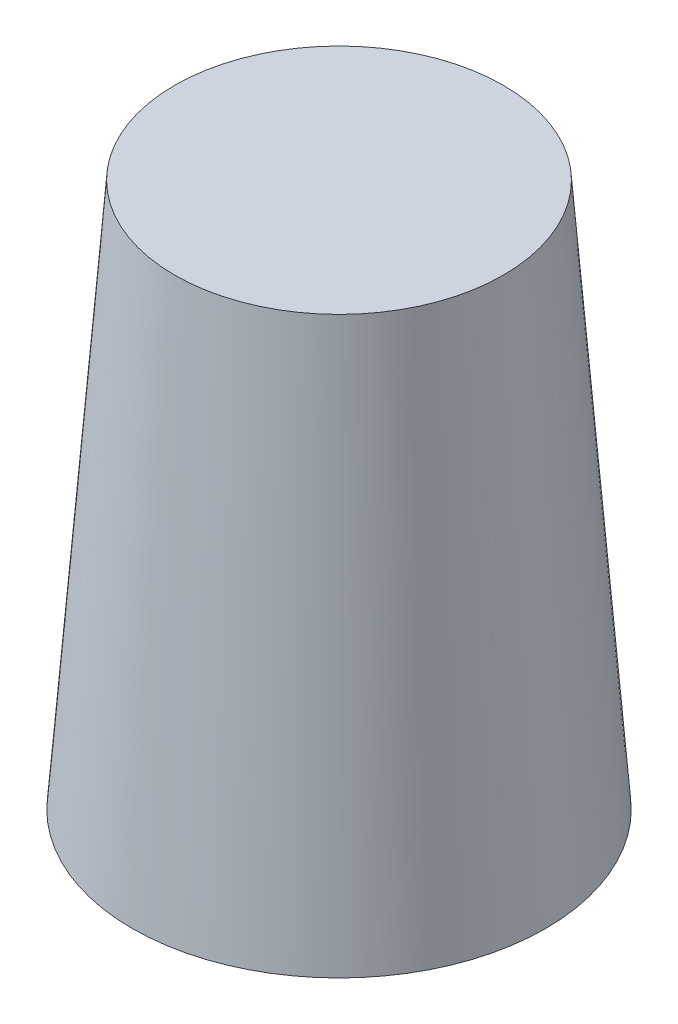
ISO-10303-21;
HEADER;
FILE_DESCRIPTION(('STEP AP214'),'2;1');
FILE_NAME('part.step','',(''),(''),'','','');
FILE_SCHEMA(('AUTOMOTIVE_DESIGN { 1 0 10303 214 1 1 1 1 }'));
ENDSEC;
DATA;
#1=APPLICATION_CONTEXT('core data for automotive mechanical design processes');
#2=APPLICATION_PROTOCOL_DEFINITION('international standard','automotive_design',2000,#1);
#3=PRODUCT_CONTEXT('',#1,'mechanical');
#4=PRODUCT('Part','Part','',(#3));
#5=PRODUCT_RELATED_PRODUCT_CATEGORY('part','',(#4));
#6=PRODUCT_DEFINITION_FORMATION('','',#4);
#7=PRODUCT_DEFINITION_CONTEXT('part definition',#1,'design');
#8=PRODUCT_DEFINITION('design','',#6,#7);
#9=PRODUCT_DEFINITION_SHAPE('','',#8);
#10=(LENGTH_UNIT() NAMED_UNIT(*) SI_UNIT(.MILLI.,.METRE.));
#11=(NAMED_UNIT(*) PLANE_ANGLE_UNIT() SI_UNIT($,.RADIAN.));
#12=(NAMED_UNIT(*) SI_UNIT($,.STERADIAN.) SOLID_ANGLE_UNIT());
#13=UNCERTAINTY_MEASURE_WITH_UNIT(LENGTH_MEASURE(1.E-05),#10,'distance_accuracy_value','');
#14=(GEOMETRIC_REPRESENTATION_CONTEXT(3) GLOBAL_UNCERTAINTY_ASSIGNED_CONTEXT((#13)) GLOBAL_UNIT_ASSIGNED_CONTEXT((#10,
#11,#12)) REPRESENTATION_CONTEXT('',''));
#15=CARTESIAN_POINT('',(0.,0.,0.));
#16=DIRECTION('',(0.,0.,1.));
#17=DIRECTION('',(1.,0.,0.));
#18=AXIS2_PLACEMENT_3D('',#15,#16,#17);
#19=CARTESIAN_POINT('',(0.,53.7037037037037,0.));
#20=DIRECTION('',(0.,-1.,0.));
#21=DIRECTION('',(0.,0.,-1.));
#22=AXIS2_PLACEMENT_3D('',#19,#20,#21);
#23=CONICAL_SURFACE('',#22,33.5,0.0785418009260727);
#24=CARTESIAN_POINT('',(0.,47.5960090746847,0.));
#25=DIRECTION('',(0.,-1.,0.));
#26=DIRECTION('',(0.,0.,-1.));
#27=AXIS2_PLACEMENT_3D('',#24,#25,#26);
#28=CIRCLE('',#27,33.980698188395);
#29=CARTESIAN_POINT('',(0.,47.5960090746847,-33.980698188395));
#30=VERTEX_POINT('',#29);
#31=EDGE_CURVE('E10',#30,#30,#28,.F.);
#32=ORIENTED_EDGE('',*,*,#31,.T.);
#33=EDGE_LOOP('',(#32));
#34=FACE_BOUND('',#33,.T.);
#35=CARTESIAN_POINT('',(0.,-62.2962962962963,0.));
#36=DIRECTION('',(0.,1.,0.));
#37=DIRECTION('',(0.,0.,1.));
#38=AXIS2_PLACEMENT_3D('',#35,#36,#37);
#39=CIRCLE('',#38,42.6296296296297);
#40=CARTESIAN_POINT('',(0.,-62.2962962962963,42.6296296296297));
#41=VERTEX_POINT('',#40);
#42=EDGE_CURVE('E57',#41,#41,#39,.T.);
#43=ORIENTED_EDGE('',*,*,#42,.F.);
#44=EDGE_LOOP('',(#43));
#45=FACE_BOUND('',#44,.T.);
#46=ADVANCED_FACE('F37',(#34,#45),#23,.F.);
#47=CARTESIAN_POINT('',(33.5,53.7037037037037,0.));
#48=DIRECTION('',(0.,-1.,0.));
#49=DIRECTION('',(0.,0.,-1.));
#50=AXIS2_PLACEMENT_3D('',#47,#48,#49);
#51=PLANE('',#50);
#52=CARTESIAN_POINT('',(0.,53.7037037037037,0.));
#53=DIRECTION('',(0.,1.,0.));
#54=DIRECTION('',(0.,0.,1.));
#55=AXIS2_PLACEMENT_3D('',#52,#53,#54);
#56=CIRCLE('',#55,35.);
#57=CARTESIAN_POINT('',(0.,53.7037037037037,35.));
#58=VERTEX_POINT('',#57);
#59=EDGE_CURVE('E48',#58,#58,#56,.T.);
#60=ORIENTED_EDGE('',*,*,#59,.T.);
#61=EDGE_LOOP('',(#60));
#62=FACE_BOUND('',#61,.T.);
#63=ADVANCED_FACE('F64',(#62),#51,.F.);
#64=CARTESIAN_POINT('',(0.,-62.2962962962963,0.));
#65=DIRECTION('',(0.,-1.,0.));
#66=DIRECTION('',(0.,0.,-1.));
#67=AXIS2_PLACEMENT_3D('',#64,#65,#66);
#68=CONICAL_SURFACE('',#67,44.,0.077431086955443);
#69=ORIENTED_EDGE('',*,*,#59,.F.);
#70=EDGE_LOOP('',(#69));
#71=FACE_BOUND('',#70,.T.);
#72=CARTESIAN_POINT('',(0.,-62.2962962962963,0.));
#73=DIRECTION('',(0.,1.,0.));
#74=DIRECTION('',(0.,0.,1.));
#75=AXIS2_PLACEMENT_3D('',#72,#73,#74);
#76=CIRCLE('',#75,44.);
#77=CARTESIAN_POINT('',(0.,-62.2962962962963,44.));
#78=VERTEX_POINT('',#77);
#79=EDGE_CURVE('E52',#78,#78,#76,.T.);
#80=ORIENTED_EDGE('',*,*,#79,.T.);
#81=EDGE_LOOP('',(#80));
#82=FACE_BOUND('',#81,.T.);
#83=ADVANCED_FACE('F70',(#71,#82),#68,.T.);
#84=CARTESIAN_POINT('',(42.6296296296297,-62.2962962962963,0.));
#85=DIRECTION('',(0.,1.,0.));
#86=DIRECTION('',(0.,0.,1.));
#87=AXIS2_PLACEMENT_3D('',#84,#85,#86);
#88=PLANE('',#87);
#89=ORIENTED_EDGE('',*,*,#79,.F.);
#90=EDGE_LOOP('',(#89));
#91=FACE_BOUND('',#90,.T.);
#92=ORIENTED_EDGE('',*,*,#42,.T.);
#93=EDGE_LOOP('',(#92));
#94=FACE_BOUND('',#93,.T.);
#95=ADVANCED_FACE('F61',(#91,#94),#88,.F.);
#96=CARTESIAN_POINT('',(0.,52.2037037037037,0.));
#97=DIRECTION('',(0.,1.,0.));
#98=DIRECTION('',(0.,0.,1.));
#99=AXIS2_PLACEMENT_3D('',#96,#97,#98);
#100=PLANE('',#99);
#101=CARTESIAN_POINT('',(0.,52.2037037037037,0.));
#102=DIRECTION('',(0.,1.,0.));
#103=DIRECTION('',(0.,0.,1.));
#104=AXIS2_PLACEMENT_3D('',#101,#102,#103);
#105=CIRCLE('',#104,28.9961122982834);
#106=CARTESIAN_POINT('',(0.,52.2037037037037,28.9961122982834));
#107=VERTEX_POINT('',#106);
#108=EDGE_CURVE('E44',#107,#107,#105,.F.);
#109=ORIENTED_EDGE('',*,*,#108,.T.);
#110=EDGE_LOOP('',(#109));
#111=FACE_BOUND('',#110,.T.);
#112=ADVANCED_FACE('F74',(#111),#100,.F.);
#113=CARTESIAN_POINT('',(0.,47.2037037037037,0.));
#114=DIRECTION('',(0.,1.,0.));
#115=DIRECTION('',(0.,0.,1.));
#116=AXIS2_PLACEMENT_3D('',#113,#114,#115);
#117=TOROIDAL_SURFACE('',#116,28.9961122982834,5.);
#118=ORIENTED_EDGE('',*,*,#31,.F.);
#119=EDGE_LOOP('',(#118));
#120=FACE_BOUND('',#119,.T.);
#121=ORIENTED_EDGE('',*,*,#108,.F.);
#122=EDGE_LOOP('',(#121));
#123=FACE_BOUND('',#122,.T.);
#124=ADVANCED_FACE('F39',(#120,#123),#117,.F.);
#125=CLOSED_SHELL('',(#46,#63,#83,#95,#112,#124));
#126=MANIFOLD_SOLID_BREP('B2',#125);
#127=ADVANCED_BREP_SHAPE_REPRESENTATION('',(#18,#126),#14);
#128=SHAPE_DEFINITION_REPRESENTATION(#9,#127);
ENDSEC;
END-ISO-10303-21;
